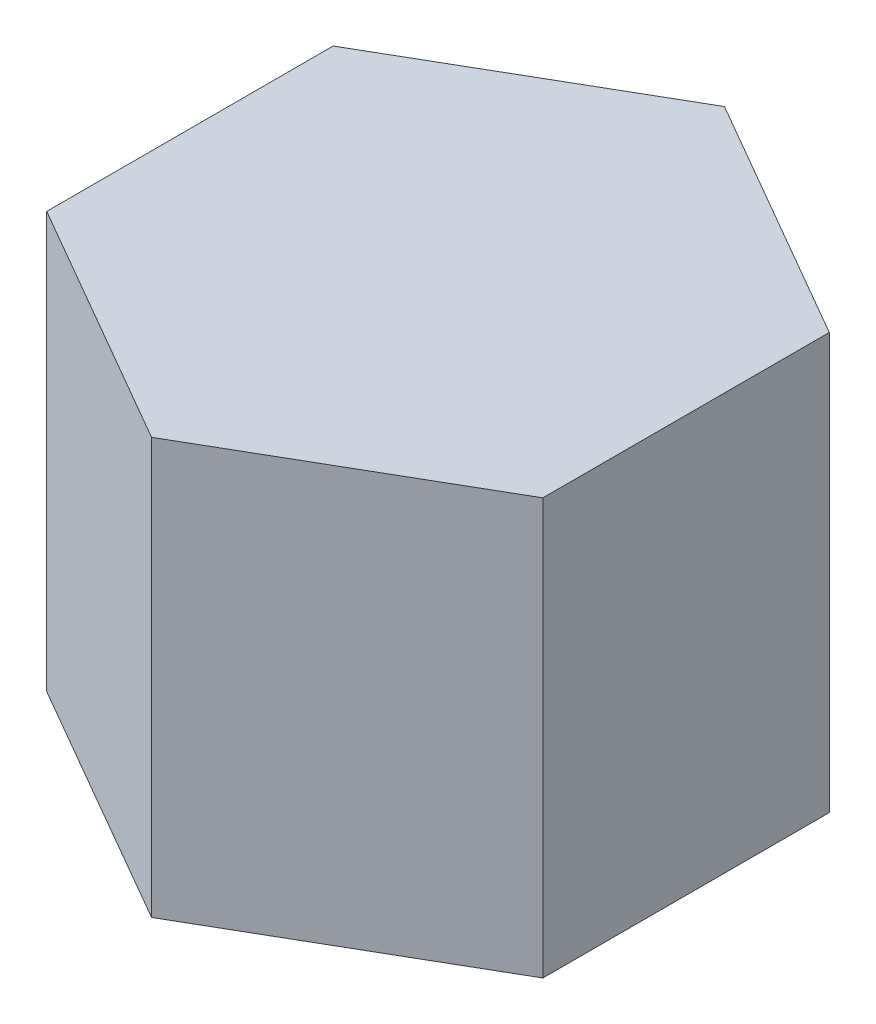
ISO-10303-21;
HEADER;
FILE_DESCRIPTION(('STEP AP214'),'2;1');
FILE_NAME('part.step','',(''),(''),'','','');
FILE_SCHEMA(('AUTOMOTIVE_DESIGN { 1 0 10303 214 1 1 1 1 }'));
ENDSEC;
DATA;
#1=APPLICATION_CONTEXT('core data for automotive mechanical design processes');
#2=APPLICATION_PROTOCOL_DEFINITION('international standard','automotive_design',2000,#1);
#3=PRODUCT_CONTEXT('',#1,'mechanical');
#4=PRODUCT('Part','Part','',(#3));
#5=PRODUCT_RELATED_PRODUCT_CATEGORY('part','',(#4));
#6=PRODUCT_DEFINITION_FORMATION('','',#4);
#7=PRODUCT_DEFINITION_CONTEXT('part definition',#1,'design');
#8=PRODUCT_DEFINITION('design','',#6,#7);
#9=PRODUCT_DEFINITION_SHAPE('','',#8);
#10=(LENGTH_UNIT() NAMED_UNIT(*) SI_UNIT(.MILLI.,.METRE.));
#11=(NAMED_UNIT(*) PLANE_ANGLE_UNIT() SI_UNIT($,.RADIAN.));
#12=(NAMED_UNIT(*) SI_UNIT($,.STERADIAN.) SOLID_ANGLE_UNIT());
#13=UNCERTAINTY_MEASURE_WITH_UNIT(LENGTH_MEASURE(1.E-05),#10,'distance_accuracy_value','');
#14=(GEOMETRIC_REPRESENTATION_CONTEXT(3) GLOBAL_UNCERTAINTY_ASSIGNED_CONTEXT((#13)) GLOBAL_UNIT_ASSIGNED_CONTEXT((#10,
#11,#12)) REPRESENTATION_CONTEXT('',''));
#15=CARTESIAN_POINT('',(0.,0.,0.));
#16=DIRECTION('',(0.,0.,1.));
#17=DIRECTION('',(1.,0.,0.));
#18=AXIS2_PLACEMENT_3D('',#15,#16,#17);
#19=CARTESIAN_POINT('',(208.142660308706,-148.537700895744,287.176844201572));
#20=DIRECTION('',(-0.499999999999943,0.,-0.866025403784472));
#21=DIRECTION('',(-0.866025403784472,0.,0.499999999999943));
#22=AXIS2_PLACEMENT_3D('',#19,#20,#21);
#23=PLANE('',#22);
#24=CARTESIAN_POINT('',(207.839551417382,-149.045793579175,287.351844201572));
#25=DIRECTION('',(0.866025403784471,0.,-0.499999999999943));
#26=VECTOR('',#25,1.);
#27=LINE('',#24,#26);
#28=CARTESIAN_POINT('',(207.839551417382,-149.045793579175,287.351844201572));
#29=VERTEX_POINT('',#28);
#30=CARTESIAN_POINT('',(208.142660308706,-149.045793579175,287.176844201572));
#31=VERTEX_POINT('',#30);
#32=EDGE_CURVE('E170',#29,#31,#27,.T.);
#33=ORIENTED_EDGE('',*,*,#32,.T.);
#34=CARTESIAN_POINT('',(208.142660308706,-148.537700895744,287.176844201572));
#35=DIRECTION('',(0.,-1.,0.));
#36=VECTOR('',#35,1.);
#37=LINE('',#34,#36);
#38=CARTESIAN_POINT('',(208.142660308706,-148.537700895744,287.176844201572));
#39=VERTEX_POINT('',#38);
#40=EDGE_CURVE('E35',#39,#31,#37,.T.);
#41=ORIENTED_EDGE('',*,*,#40,.F.);
#42=CARTESIAN_POINT('',(207.839551417382,-148.537700895744,287.351844201572));
#43=DIRECTION('',(0.866025403784471,0.,-0.499999999999943));
#44=VECTOR('',#43,1.);
#45=LINE('',#42,#44);
#46=CARTESIAN_POINT('',(207.839551417382,-148.537700895744,287.351844201572));
#47=VERTEX_POINT('',#46);
#48=EDGE_CURVE('E159',#47,#39,#45,.T.);
#49=ORIENTED_EDGE('',*,*,#48,.F.);
#50=CARTESIAN_POINT('',(207.839551417382,-148.537700895744,287.351844201572));
#51=DIRECTION('',(0.,-1.,0.));
#52=VECTOR('',#51,1.);
#53=LINE('',#50,#52);
#54=EDGE_CURVE('E10',#47,#29,#53,.T.);
#55=ORIENTED_EDGE('',*,*,#54,.T.);
#56=EDGE_LOOP('',(#33,#41,#49,#55));
#57=FACE_BOUND('',#56,.T.);
#58=ADVANCED_FACE('F16',(#57),#23,.F.);
#59=CARTESIAN_POINT('',(207.839551417382,-148.537700895744,287.351844201572));
#60=DIRECTION('',(0.499999999999978,0.,-0.866025403784452));
#61=DIRECTION('',(-0.866025403784452,0.,-0.499999999999978));
#62=AXIS2_PLACEMENT_3D('',#59,#60,#61);
#63=PLANE('',#62);
#64=CARTESIAN_POINT('',(207.536442526057,-149.045793579175,287.176844201572));
#65=DIRECTION('',(0.866025403784452,0.,0.499999999999978));
#66=VECTOR('',#65,1.);
#67=LINE('',#64,#66);
#68=CARTESIAN_POINT('',(207.536442526057,-149.045793579175,287.176844201572));
#69=VERTEX_POINT('',#68);
#70=EDGE_CURVE('E167',#69,#29,#67,.T.);
#71=ORIENTED_EDGE('',*,*,#70,.T.);
#72=ORIENTED_EDGE('',*,*,#54,.F.);
#73=CARTESIAN_POINT('',(207.536442526057,-148.537700895744,287.176844201572));
#74=DIRECTION('',(0.866025403784452,0.,0.499999999999978));
#75=VECTOR('',#74,1.);
#76=LINE('',#73,#75);
#77=CARTESIAN_POINT('',(207.536442526057,-148.537700895744,287.176844201572));
#78=VERTEX_POINT('',#77);
#79=EDGE_CURVE('E156',#78,#47,#76,.T.);
#80=ORIENTED_EDGE('',*,*,#79,.F.);
#81=CARTESIAN_POINT('',(207.536442526057,-148.537700895744,287.176844201572));
#82=DIRECTION('',(0.,-1.,0.));
#83=VECTOR('',#82,1.);
#84=LINE('',#81,#83);
#85=EDGE_CURVE('E27',#78,#69,#84,.T.);
#86=ORIENTED_EDGE('',*,*,#85,.T.);
#87=EDGE_LOOP('',(#71,#72,#80,#86));
#88=FACE_BOUND('',#87,.T.);
#89=ADVANCED_FACE('F189',(#88),#63,.F.);
#90=CARTESIAN_POINT('',(207.536442526057,-148.537700895744,290.831971220494));
#91=DIRECTION('',(1.,0.,0.));
#92=DIRECTION('',(0.,1.,0.));
#93=AXIS2_PLACEMENT_3D('',#90,#91,#92);
#94=PLANE('',#93);
#95=CARTESIAN_POINT('',(207.536442526057,-149.045793579175,286.826844201572));
#96=DIRECTION('',(0.,0.,1.));
#97=VECTOR('',#96,1.);
#98=LINE('',#95,#97);
#99=CARTESIAN_POINT('',(207.536442526057,-149.045793579175,286.826844201572));
#100=VERTEX_POINT('',#99);
#101=EDGE_CURVE('E163',#100,#69,#98,.T.);
#102=ORIENTED_EDGE('',*,*,#101,.T.);
#103=ORIENTED_EDGE('',*,*,#85,.F.);
#104=CARTESIAN_POINT('',(207.536442526057,-148.537700895744,286.826844201572));
#105=DIRECTION('',(0.,0.,1.));
#106=VECTOR('',#105,1.);
#107=LINE('',#104,#106);
#108=CARTESIAN_POINT('',(207.536442526057,-148.537700895744,286.826844201572));
#109=VERTEX_POINT('',#108);
#110=EDGE_CURVE('E106',#109,#78,#107,.T.);
#111=ORIENTED_EDGE('',*,*,#110,.F.);
#112=CARTESIAN_POINT('',(207.536442526057,-148.537700895744,286.826844201572));
#113=DIRECTION('',(0.,-1.,0.));
#114=VECTOR('',#113,1.);
#115=LINE('',#112,#114);
#116=EDGE_CURVE('E94',#109,#100,#115,.T.);
#117=ORIENTED_EDGE('',*,*,#116,.T.);
#118=EDGE_LOOP('',(#102,#103,#111,#117));
#119=FACE_BOUND('',#118,.T.);
#120=ADVANCED_FACE('F198',(#119),#94,.F.);
#121=CARTESIAN_POINT('',(207.536442526057,-148.537700895744,286.826844201572));
#122=DIRECTION('',(0.499999999999978,0.,0.866025403784452));
#123=DIRECTION('',(0.866025403784452,0.,-0.499999999999978));
#124=AXIS2_PLACEMENT_3D('',#121,#122,#123);
#125=PLANE('',#124);
#126=CARTESIAN_POINT('',(207.839551417382,-149.045793579175,286.651844201572));
#127=DIRECTION('',(-0.866025403784452,0.,0.499999999999978));
#128=VECTOR('',#127,1.);
#129=LINE('',#126,#128);
#130=CARTESIAN_POINT('',(207.839551417382,-149.045793579175,286.651844201572));
#131=VERTEX_POINT('',#130);
#132=EDGE_CURVE('E162',#131,#100,#129,.T.);
#133=ORIENTED_EDGE('',*,*,#132,.T.);
#134=ORIENTED_EDGE('',*,*,#116,.F.);
#135=CARTESIAN_POINT('',(207.839551417382,-148.537700895744,286.651844201572));
#136=DIRECTION('',(-0.866025403784452,0.,0.499999999999978));
#137=VECTOR('',#136,1.);
#138=LINE('',#135,#137);
#139=CARTESIAN_POINT('',(207.839551417382,-148.537700895744,286.651844201572));
#140=VERTEX_POINT('',#139);
#141=EDGE_CURVE('E98',#140,#109,#138,.T.);
#142=ORIENTED_EDGE('',*,*,#141,.F.);
#143=CARTESIAN_POINT('',(207.839551417382,-148.537700895744,286.651844201572));
#144=DIRECTION('',(0.,-1.,0.));
#145=VECTOR('',#144,1.);
#146=LINE('',#143,#145);
#147=EDGE_CURVE('E79',#140,#131,#146,.T.);
#148=ORIENTED_EDGE('',*,*,#147,.T.);
#149=EDGE_LOOP('',(#133,#134,#142,#148));
#150=FACE_BOUND('',#149,.T.);
#151=ADVANCED_FACE('F100',(#150),#125,.F.);
#152=CARTESIAN_POINT('',(207.839551417382,-148.537700895744,286.651844201572));
#153=DIRECTION('',(-0.500000000000096,0.,0.866025403784383));
#154=DIRECTION('',(0.866025403784383,0.,0.500000000000096));
#155=AXIS2_PLACEMENT_3D('',#152,#153,#154);
#156=PLANE('',#155);
#157=CARTESIAN_POINT('',(208.142660308706,-149.045793579175,286.826844201572));
#158=DIRECTION('',(-0.866025403784383,0.,-0.500000000000096));
#159=VECTOR('',#158,1.);
#160=LINE('',#157,#159);
#161=CARTESIAN_POINT('',(208.142660308706,-149.045793579175,286.826844201572));
#162=VERTEX_POINT('',#161);
#163=EDGE_CURVE('E88',#162,#131,#160,.T.);
#164=ORIENTED_EDGE('',*,*,#163,.T.);
#165=ORIENTED_EDGE('',*,*,#147,.F.);
#166=CARTESIAN_POINT('',(208.142660308706,-148.537700895744,286.826844201572));
#167=DIRECTION('',(-0.866025403784383,0.,-0.500000000000096));
#168=VECTOR('',#167,1.);
#169=LINE('',#166,#168);
#170=CARTESIAN_POINT('',(208.142660308706,-148.537700895744,286.826844201572));
#171=VERTEX_POINT('',#170);
#172=EDGE_CURVE('E84',#171,#140,#169,.T.);
#173=ORIENTED_EDGE('',*,*,#172,.F.);
#174=CARTESIAN_POINT('',(208.142660308706,-148.537700895744,286.826844201572));
#175=DIRECTION('',(0.,-1.,0.));
#176=VECTOR('',#175,1.);
#177=LINE('',#174,#176);
#178=EDGE_CURVE('E58',#171,#162,#177,.T.);
#179=ORIENTED_EDGE('',*,*,#178,.T.);
#180=EDGE_LOOP('',(#164,#165,#173,#179));
#181=FACE_BOUND('',#180,.T.);
#182=ADVANCED_FACE('F82',(#181),#156,.F.);
#183=CARTESIAN_POINT('',(208.142660308706,-148.537700895744,290.831971220494));
#184=DIRECTION('',(-1.,0.,0.));
#185=DIRECTION('',(0.,-1.,0.));
#186=AXIS2_PLACEMENT_3D('',#183,#184,#185);
#187=PLANE('',#186);
#188=CARTESIAN_POINT('',(208.142660308706,-149.045793579175,287.176844201572));
#189=DIRECTION('',(0.,0.,-1.));
#190=VECTOR('',#189,1.);
#191=LINE('',#188,#190);
#192=EDGE_CURVE('E160',#31,#162,#191,.T.);
#193=ORIENTED_EDGE('',*,*,#192,.T.);
#194=ORIENTED_EDGE('',*,*,#178,.F.);
#195=CARTESIAN_POINT('',(208.142660308706,-148.537700895744,287.176844201572));
#196=DIRECTION('',(0.,0.,-1.));
#197=VECTOR('',#196,1.);
#198=LINE('',#195,#197);
#199=EDGE_CURVE('E112',#39,#171,#198,.T.);
#200=ORIENTED_EDGE('',*,*,#199,.F.);
#201=ORIENTED_EDGE('',*,*,#40,.T.);
#202=EDGE_LOOP('',(#193,#194,#200,#201));
#203=FACE_BOUND('',#202,.T.);
#204=ADVANCED_FACE('F131',(#203),#187,.F.);
#205=CARTESIAN_POINT('',(206.339551417382,-148.537700895744,290.831971220494));
#206=DIRECTION('',(0.,-1.,0.));
#207=DIRECTION('',(1.,0.,0.));
#208=AXIS2_PLACEMENT_3D('',#205,#206,#207);
#209=PLANE('',#208);
#210=ORIENTED_EDGE('',*,*,#48,.T.);
#211=ORIENTED_EDGE('',*,*,#199,.T.);
#212=ORIENTED_EDGE('',*,*,#172,.T.);
#213=ORIENTED_EDGE('',*,*,#141,.T.);
#214=ORIENTED_EDGE('',*,*,#110,.T.);
#215=ORIENTED_EDGE('',*,*,#79,.T.);
#216=EDGE_LOOP('',(#210,#211,#212,#213,#214,#215));
#217=FACE_BOUND('',#216,.T.);
#218=ADVANCED_FACE('F111',(#217),#209,.F.);
#219=CARTESIAN_POINT('',(206.339551417382,-149.045793579175,290.831971220494));
#220=DIRECTION('',(0.,-1.,0.));
#221=DIRECTION('',(1.,0.,0.));
#222=AXIS2_PLACEMENT_3D('',#219,#220,#221);
#223=PLANE('',#222);
#224=ORIENTED_EDGE('',*,*,#32,.F.);
#225=ORIENTED_EDGE('',*,*,#70,.F.);
#226=ORIENTED_EDGE('',*,*,#101,.F.);
#227=ORIENTED_EDGE('',*,*,#132,.F.);
#228=ORIENTED_EDGE('',*,*,#163,.F.);
#229=ORIENTED_EDGE('',*,*,#192,.F.);
#230=EDGE_LOOP('',(#224,#225,#226,#227,#228,#229));
#231=FACE_BOUND('',#230,.T.);
#232=ADVANCED_FACE('F130',(#231),#223,.T.);
#233=CLOSED_SHELL('',(#58,#89,#120,#151,#182,#204,#218,#232));
#234=MANIFOLD_SOLID_BREP('B1',#233);
#235=ADVANCED_BREP_SHAPE_REPRESENTATION('',(#18,#234),#14);
#236=SHAPE_DEFINITION_REPRESENTATION(#9,#235);
ENDSEC;
END-ISO-10303-21;
